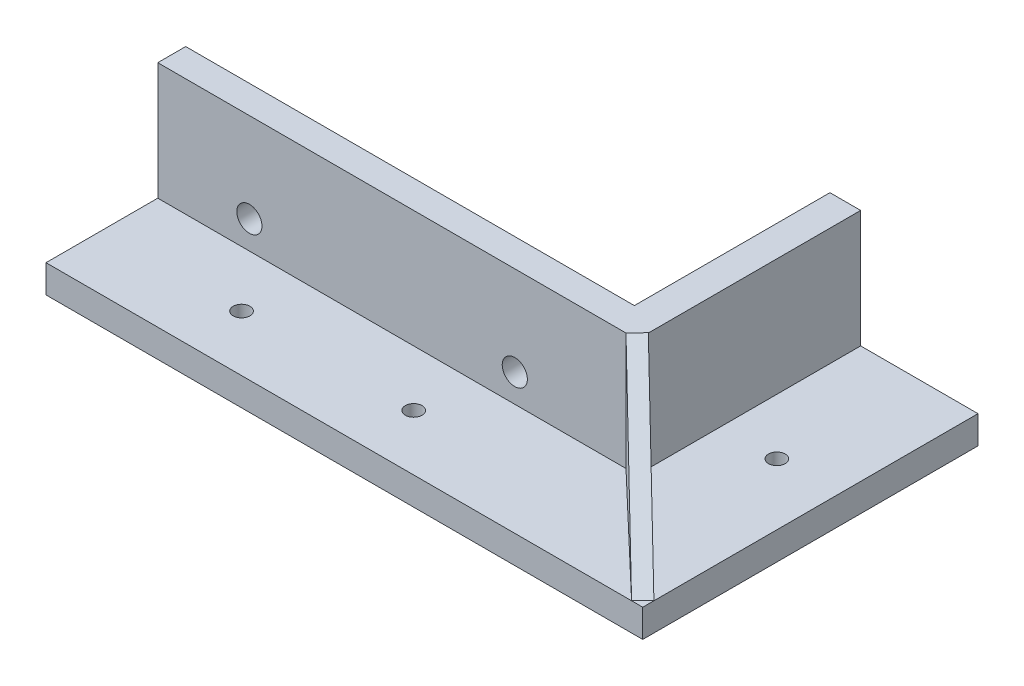
ISO-10303-21;
HEADER;
FILE_DESCRIPTION(('STEP AP214'),'2;1');
FILE_NAME('part.step','',(''),(''),'','','');
FILE_SCHEMA(('AUTOMOTIVE_DESIGN { 1 0 10303 214 1 1 1 1 }'));
ENDSEC;
DATA;
#1=APPLICATION_CONTEXT('core data for automotive mechanical design processes');
#2=APPLICATION_PROTOCOL_DEFINITION('international standard','automotive_design',2000,#1);
#3=PRODUCT_CONTEXT('',#1,'mechanical');
#4=PRODUCT('Part','Part','',(#3));
#5=PRODUCT_RELATED_PRODUCT_CATEGORY('part','',(#4));
#6=PRODUCT_DEFINITION_FORMATION('','',#4);
#7=PRODUCT_DEFINITION_CONTEXT('part definition',#1,'design');
#8=PRODUCT_DEFINITION('design','',#6,#7);
#9=PRODUCT_DEFINITION_SHAPE('','',#8);
#10=(LENGTH_UNIT() NAMED_UNIT(*) SI_UNIT(.MILLI.,.METRE.));
#11=(NAMED_UNIT(*) PLANE_ANGLE_UNIT() SI_UNIT($,.RADIAN.));
#12=(NAMED_UNIT(*) SI_UNIT($,.STERADIAN.) SOLID_ANGLE_UNIT());
#13=UNCERTAINTY_MEASURE_WITH_UNIT(LENGTH_MEASURE(1.E-05),#10,'distance_accuracy_value','');
#14=(GEOMETRIC_REPRESENTATION_CONTEXT(3) GLOBAL_UNCERTAINTY_ASSIGNED_CONTEXT((#13)) GLOBAL_UNIT_ASSIGNED_CONTEXT((#10,
#11,#12)) REPRESENTATION_CONTEXT('',''));
#15=CARTESIAN_POINT('',(0.,0.,0.));
#16=DIRECTION('',(0.,0.,1.));
#17=DIRECTION('',(1.,0.,0.));
#18=AXIS2_PLACEMENT_3D('',#15,#16,#17);
#19=CARTESIAN_POINT('',(0.,5.,-2.49999999999999));
#20=DIRECTION('',(0.,0.,-1.));
#21=DIRECTION('',(-1.,0.,0.));
#22=AXIS2_PLACEMENT_3D('',#19,#20,#21);
#23=PLANE('',#22);
#24=CARTESIAN_POINT('',(-24.,10.,-2.5));
#25=DIRECTION('',(0.,0.,-1.));
#26=DIRECTION('',(-1.,0.,0.));
#27=AXIS2_PLACEMENT_3D('',#24,#25,#26);
#28=CIRCLE('',#27,2.25);
#29=CARTESIAN_POINT('',(-26.25,10.,-2.5));
#30=VERTEX_POINT('',#29);
#31=EDGE_CURVE('E202',#30,#30,#28,.T.);
#32=ORIENTED_EDGE('',*,*,#31,.F.);
#33=EDGE_LOOP('',(#32));
#34=FACE_BOUND('',#33,.T.);
#35=CARTESIAN_POINT('',(23.5,10.,-2.5));
#36=DIRECTION('',(0.,0.,-1.));
#37=DIRECTION('',(-1.,0.,0.));
#38=AXIS2_PLACEMENT_3D('',#35,#36,#37);
#39=CIRCLE('',#38,2.25);
#40=CARTESIAN_POINT('',(21.25,10.,-2.5));
#41=VERTEX_POINT('',#40);
#42=EDGE_CURVE('E197',#41,#41,#39,.T.);
#43=ORIENTED_EDGE('',*,*,#42,.F.);
#44=EDGE_LOOP('',(#43));
#45=FACE_BOUND('',#44,.T.);
#46=DIRECTION('',(1.,0.,0.));
#47=VECTOR('',#46,1.);
#48=CARTESIAN_POINT('',(0.,26.,-2.49999999999999));
#49=LINE('',#48,#47);
#50=CARTESIAN_POINT('',(-40.4,26.,-2.49999999999996));
#51=VERTEX_POINT('',#50);
#52=CARTESIAN_POINT('',(39.9,26.,-2.49999999999999));
#53=VERTEX_POINT('',#52);
#54=EDGE_CURVE('E52',#51,#53,#49,.T.);
#55=ORIENTED_EDGE('',*,*,#54,.T.);
#56=DIRECTION('',(0.,1.,0.));
#57=VECTOR('',#56,1.);
#58=CARTESIAN_POINT('',(39.9,26.,-2.49999999999999));
#59=LINE('',#58,#57);
#60=CARTESIAN_POINT('',(39.9,0.,-2.49999999999999));
#61=VERTEX_POINT('',#60);
#62=EDGE_CURVE('E56',#61,#53,#59,.T.);
#63=ORIENTED_EDGE('',*,*,#62,.F.);
#64=DIRECTION('',(1.,0.,0.));
#65=VECTOR('',#64,1.);
#66=CARTESIAN_POINT('',(0.,0.,-2.49999999999999));
#67=LINE('',#66,#65);
#68=CARTESIAN_POINT('',(-40.4,0.,-2.49999999999999));
#69=VERTEX_POINT('',#68);
#70=EDGE_CURVE('E142',#69,#61,#67,.T.);
#71=ORIENTED_EDGE('',*,*,#70,.F.);
#72=DIRECTION('',(0.,-1.,0.));
#73=VECTOR('',#72,1.);
#74=CARTESIAN_POINT('',(-40.4,5.,-2.49999999999999));
#75=LINE('',#74,#73);
#76=EDGE_CURVE('E11',#51,#69,#75,.T.);
#77=ORIENTED_EDGE('',*,*,#76,.F.);
#78=EDGE_LOOP('',(#55,#63,#71,#77));
#79=FACE_BOUND('',#78,.T.);
#80=ADVANCED_FACE('F37',(#34,#45,#79),#23,.T.);
#81=CARTESIAN_POINT('',(0.,5.,22.5));
#82=DIRECTION('',(0.,0.,-1.));
#83=DIRECTION('',(-1.,0.,0.));
#84=AXIS2_PLACEMENT_3D('',#81,#82,#83);
#85=PLANE('',#84);
#86=DIRECTION('',(1.,0.,0.));
#87=VECTOR('',#86,1.);
#88=CARTESIAN_POINT('',(0.,5.,22.5));
#89=LINE('',#88,#87);
#90=CARTESIAN_POINT('',(-40.4,5.,22.5));
#91=VERTEX_POINT('',#90);
#92=CARTESIAN_POINT('',(64.4,5.,22.5));
#93=VERTEX_POINT('',#92);
#94=EDGE_CURVE('E236',#91,#93,#89,.T.);
#95=ORIENTED_EDGE('',*,*,#94,.F.);
#96=DIRECTION('',(0.,-1.,0.));
#97=VECTOR('',#96,1.);
#98=CARTESIAN_POINT('',(-40.4,5.,22.5));
#99=LINE('',#98,#97);
#100=CARTESIAN_POINT('',(-40.4,0.,22.5));
#101=VERTEX_POINT('',#100);
#102=EDGE_CURVE('E162',#91,#101,#99,.T.);
#103=ORIENTED_EDGE('',*,*,#102,.T.);
#104=DIRECTION('',(1.,0.,0.));
#105=VECTOR('',#104,1.);
#106=CARTESIAN_POINT('',(0.,0.,22.5));
#107=LINE('',#106,#105);
#108=CARTESIAN_POINT('',(66.4,0.,22.5));
#109=VERTEX_POINT('',#108);
#110=EDGE_CURVE('E235',#101,#109,#107,.T.);
#111=ORIENTED_EDGE('',*,*,#110,.T.);
#112=DIRECTION('',(0.,-1.,0.));
#113=VECTOR('',#112,1.);
#114=CARTESIAN_POINT('',(66.4,5.,22.5));
#115=LINE('',#114,#113);
#116=CARTESIAN_POINT('',(66.4,5.,22.5));
#117=VERTEX_POINT('',#116);
#118=EDGE_CURVE('E226',#117,#109,#115,.T.);
#119=ORIENTED_EDGE('',*,*,#118,.F.);
#120=DIRECTION('',(1.,0.,0.));
#121=VECTOR('',#120,1.);
#122=CARTESIAN_POINT('',(0.,5.,22.5));
#123=LINE('',#122,#121);
#124=EDGE_CURVE('E180',#93,#117,#123,.T.);
#125=ORIENTED_EDGE('',*,*,#124,.F.);
#126=EDGE_LOOP('',(#95,#103,#111,#119,#125));
#127=FACE_BOUND('',#126,.T.);
#128=ADVANCED_FACE('F39',(#127),#85,.F.);
#129=CARTESIAN_POINT('',(0.,26.,0.));
#130=DIRECTION('',(0.,1.,0.));
#131=DIRECTION('',(0.,0.,1.));
#132=AXIS2_PLACEMENT_3D('',#129,#130,#131);
#133=PLANE('',#132);
#134=DIRECTION('',(0.,0.,-1.));
#135=VECTOR('',#134,1.);
#136=CARTESIAN_POINT('',(-40.4,26.,82.5));
#137=LINE('',#136,#135);
#138=CARTESIAN_POINT('',(-40.4,26.,2.50000000000003));
#139=VERTEX_POINT('',#138);
#140=EDGE_CURVE('E153',#139,#51,#137,.T.);
#141=ORIENTED_EDGE('',*,*,#140,.F.);
#142=DIRECTION('',(1.,0.,0.));
#143=VECTOR('',#142,1.);
#144=CARTESIAN_POINT('',(0.,26.,2.5));
#145=LINE('',#144,#143);
#146=CARTESIAN_POINT('',(43.4,26.,2.49999999999999));
#147=VERTEX_POINT('',#146);
#148=EDGE_CURVE('E229',#139,#147,#145,.T.);
#149=ORIENTED_EDGE('',*,*,#148,.T.);
#150=DIRECTION('',(0.689655172413793,0.,-0.724137931034483));
#151=VECTOR('',#150,1.);
#152=CARTESIAN_POINT('',(24.0064209274673,26.,22.8632580261593));
#153=LINE('',#152,#151);
#154=CARTESIAN_POINT('',(45.4,26.,0.400000000000019));
#155=VERTEX_POINT('',#154);
#156=EDGE_CURVE('E177',#147,#155,#153,.T.);
#157=ORIENTED_EDGE('',*,*,#156,.T.);
#158=DIRECTION('',(0.,0.,1.));
#159=VECTOR('',#158,1.);
#160=CARTESIAN_POINT('',(45.4,26.,0.));
#161=LINE('',#160,#159);
#162=CARTESIAN_POINT('',(45.4,26.,-37.5));
#163=VERTEX_POINT('',#162);
#164=EDGE_CURVE('E207',#163,#155,#161,.T.);
#165=ORIENTED_EDGE('',*,*,#164,.F.);
#166=DIRECTION('',(1.,0.,0.));
#167=VECTOR('',#166,1.);
#168=CARTESIAN_POINT('',(0.,26.,-37.5));
#169=LINE('',#168,#167);
#170=CARTESIAN_POINT('',(39.9,26.,-37.5));
#171=VERTEX_POINT('',#170);
#172=EDGE_CURVE('E205',#171,#163,#169,.T.);
#173=ORIENTED_EDGE('',*,*,#172,.F.);
#174=DIRECTION('',(0.,0.,-1.));
#175=VECTOR('',#174,1.);
#176=CARTESIAN_POINT('',(39.9,26.,-37.5));
#177=LINE('',#176,#175);
#178=EDGE_CURVE('E148',#53,#171,#177,.T.);
#179=ORIENTED_EDGE('',*,*,#178,.F.);
#180=ORIENTED_EDGE('',*,*,#54,.F.);
#181=EDGE_LOOP('',(#141,#149,#157,#165,#173,#179,#180));
#182=FACE_BOUND('',#181,.T.);
#183=ADVANCED_FACE('F280',(#182),#133,.T.);
#184=CARTESIAN_POINT('',(66.4,5.,0.));
#185=DIRECTION('',(1.,0.,0.));
#186=DIRECTION('',(0.,0.,-1.));
#187=AXIS2_PLACEMENT_3D('',#184,#185,#186);
#188=PLANE('',#187);
#189=DIRECTION('',(0.,0.,1.));
#190=VECTOR('',#189,1.);
#191=CARTESIAN_POINT('',(66.4,5.,0.));
#192=LINE('',#191,#190);
#193=CARTESIAN_POINT('',(66.4,5.,-37.5));
#194=VERTEX_POINT('',#193);
#195=EDGE_CURVE('E216',#194,#117,#192,.T.);
#196=ORIENTED_EDGE('',*,*,#195,.T.);
#197=ORIENTED_EDGE('',*,*,#118,.T.);
#198=DIRECTION('',(0.,0.,1.));
#199=VECTOR('',#198,1.);
#200=CARTESIAN_POINT('',(66.4,0.,0.));
#201=LINE('',#200,#199);
#202=CARTESIAN_POINT('',(66.4,0.,-37.5));
#203=VERTEX_POINT('',#202);
#204=EDGE_CURVE('E133',#203,#109,#201,.T.);
#205=ORIENTED_EDGE('',*,*,#204,.F.);
#206=DIRECTION('',(0.,-1.,0.));
#207=VECTOR('',#206,1.);
#208=CARTESIAN_POINT('',(66.4,5.,-37.5));
#209=LINE('',#208,#207);
#210=EDGE_CURVE('E129',#194,#203,#209,.T.);
#211=ORIENTED_EDGE('',*,*,#210,.F.);
#212=EDGE_LOOP('',(#196,#197,#205,#211));
#213=FACE_BOUND('',#212,.T.);
#214=ADVANCED_FACE('F303',(#213),#188,.T.);
#215=CARTESIAN_POINT('',(45.4,26.,0.));
#216=DIRECTION('',(1.,0.,0.));
#217=DIRECTION('',(0.,0.,-1.));
#218=AXIS2_PLACEMENT_3D('',#215,#216,#217);
#219=PLANE('',#218);
#220=ORIENTED_EDGE('',*,*,#164,.T.);
#221=DIRECTION('',(0.,-0.446788032480034,0.894639845989782));
#222=VECTOR('',#221,1.);
#223=CARTESIAN_POINT('',(45.4,26.1598857506272,0.0798478183869559));
#224=LINE('',#223,#222);
#225=CARTESIAN_POINT('',(45.4,25.9500594530321,0.500000000000007));
#226=VERTEX_POINT('',#225);
#227=EDGE_CURVE('E174',#155,#226,#224,.T.);
#228=ORIENTED_EDGE('',*,*,#227,.T.);
#229=DIRECTION('',(0.,-1.,0.));
#230=VECTOR('',#229,1.);
#231=CARTESIAN_POINT('',(45.4,26.,0.500000000000007));
#232=LINE('',#231,#230);
#233=CARTESIAN_POINT('',(45.4,5.,0.500000000000007));
#234=VERTEX_POINT('',#233);
#235=EDGE_CURVE('E191',#226,#234,#232,.T.);
#236=ORIENTED_EDGE('',*,*,#235,.T.);
#237=DIRECTION('',(0.,0.,-1.));
#238=VECTOR('',#237,1.);
#239=CARTESIAN_POINT('',(45.4,5.,0.));
#240=LINE('',#239,#238);
#241=CARTESIAN_POINT('',(45.4,5.00000000000001,-37.5));
#242=VERTEX_POINT('',#241);
#243=EDGE_CURVE('E134',#234,#242,#240,.T.);
#244=ORIENTED_EDGE('',*,*,#243,.T.);
#245=DIRECTION('',(0.,-1.,0.));
#246=VECTOR('',#245,1.);
#247=CARTESIAN_POINT('',(45.4,26.,-37.5));
#248=LINE('',#247,#246);
#249=EDGE_CURVE('E210',#163,#242,#248,.T.);
#250=ORIENTED_EDGE('',*,*,#249,.F.);
#251=EDGE_LOOP('',(#220,#228,#236,#244,#250));
#252=FACE_BOUND('',#251,.T.);
#253=ADVANCED_FACE('F306',(#252),#219,.T.);
#254=CARTESIAN_POINT('',(66.4,26.,20.5));
#255=DIRECTION('',(0.689655172413793,0.,-0.724137931034483));
#256=DIRECTION('',(-0.724137931034483,0.,-0.689655172413793));
#257=AXIS2_PLACEMENT_3D('',#254,#255,#256);
#258=PLANE('',#257);
#259=ORIENTED_EDGE('',*,*,#235,.F.);
#260=DIRECTION('',(0.586509812151843,-0.586509812151843,0.558580773477945));
#261=VECTOR('',#260,1.);
#262=CARTESIAN_POINT('',(59.1589518087263,12.1911076443058,13.6037636273584));
#263=LINE('',#262,#261);
#264=CARTESIAN_POINT('',(66.3500594530321,5.,20.4524375743163));
#265=VERTEX_POINT('',#264);
#266=EDGE_CURVE('E171',#226,#265,#263,.T.);
#267=ORIENTED_EDGE('',*,*,#266,.T.);
#268=DIRECTION('',(0.724137931034483,0.,0.689655172413793));
#269=VECTOR('',#268,1.);
#270=CARTESIAN_POINT('',(66.4,5.,20.5));
#271=LINE('',#270,#269);
#272=EDGE_CURVE('E183',#234,#265,#271,.T.);
#273=ORIENTED_EDGE('',*,*,#272,.F.);
#274=EDGE_LOOP('',(#259,#267,#273));
#275=FACE_BOUND('',#274,.T.);
#276=ADVANCED_FACE('F311',(#275),#258,.T.);
#277=CARTESIAN_POINT('',(43.4,26.,2.50000000000001));
#278=DIRECTION('',(-0.689655172413793,0.,0.724137931034483));
#279=DIRECTION('',(0.724137931034483,0.,0.689655172413793));
#280=AXIS2_PLACEMENT_3D('',#277,#278,#279);
#281=PLANE('',#280);
#282=DIRECTION('',(-0.724137931034483,0.,-0.689655172413793));
#283=VECTOR('',#282,1.);
#284=CARTESIAN_POINT('',(43.4,5.,2.50000000000001));
#285=LINE('',#284,#283);
#286=CARTESIAN_POINT('',(43.4,5.,2.49999999999999));
#287=VERTEX_POINT('',#286);
#288=EDGE_CURVE('E186',#93,#287,#285,.T.);
#289=ORIENTED_EDGE('',*,*,#288,.F.);
#290=DIRECTION('',(-0.586509812151843,0.586509812151843,-0.558580773477946));
#291=VECTOR('',#290,1.);
#292=CARTESIAN_POINT('',(64.4,5.,22.5));
#293=LINE('',#292,#291);
#294=EDGE_CURVE('E165',#93,#147,#293,.T.);
#295=ORIENTED_EDGE('',*,*,#294,.T.);
#296=DIRECTION('',(0.,-1.,0.));
#297=VECTOR('',#296,1.);
#298=CARTESIAN_POINT('',(43.4,26.,2.50000000000001));
#299=LINE('',#298,#297);
#300=EDGE_CURVE('E188',#147,#287,#299,.T.);
#301=ORIENTED_EDGE('',*,*,#300,.T.);
#302=EDGE_LOOP('',(#289,#295,#301));
#303=FACE_BOUND('',#302,.T.);
#304=ADVANCED_FACE('F297',(#303),#281,.T.);
#305=CARTESIAN_POINT('',(0.,5.,0.));
#306=DIRECTION('',(0.,1.,0.));
#307=DIRECTION('',(0.,0.,1.));
#308=AXIS2_PLACEMENT_3D('',#305,#306,#307);
#309=PLANE('',#308);
#310=ORIENTED_EDGE('',*,*,#124,.T.);
#311=ORIENTED_EDGE('',*,*,#195,.F.);
#312=DIRECTION('',(1.,0.,0.));
#313=VECTOR('',#312,1.);
#314=CARTESIAN_POINT('',(0.,5.,-37.5));
#315=LINE('',#314,#313);
#316=EDGE_CURVE('E214',#242,#194,#315,.T.);
#317=ORIENTED_EDGE('',*,*,#316,.F.);
#318=ORIENTED_EDGE('',*,*,#243,.F.);
#319=ORIENTED_EDGE('',*,*,#272,.T.);
#320=DIRECTION('',(-0.689655172413793,0.,0.724137931034483));
#321=VECTOR('',#320,1.);
#322=CARTESIAN_POINT('',(78.8827586206896,5.,7.29310344827587));
#323=LINE('',#322,#321);
#324=EDGE_CURVE('E168',#265,#93,#323,.T.);
#325=ORIENTED_EDGE('',*,*,#324,.T.);
#326=EDGE_LOOP('',(#310,#311,#317,#318,#319,#325));
#327=FACE_BOUND('',#326,.T.);
#328=CARTESIAN_POINT('',(55.4,5.,-12.5));
#329=DIRECTION('',(0.,1.,0.));
#330=DIRECTION('',(0.,0.,1.));
#331=AXIS2_PLACEMENT_3D('',#328,#329,#330);
#332=CIRCLE('',#331,1.5);
#333=CARTESIAN_POINT('',(55.4,5.,-11.));
#334=VERTEX_POINT('',#333);
#335=EDGE_CURVE('E219',#334,#334,#332,.F.);
#336=ORIENTED_EDGE('',*,*,#335,.T.);
#337=EDGE_LOOP('',(#336));
#338=FACE_BOUND('',#337,.T.);
#339=ADVANCED_FACE('F293',(#327,#338),#309,.T.);
#340=DIRECTION('',(0.,0.,-1.));
#341=VECTOR('',#340,1.);
#342=CARTESIAN_POINT('',(-40.4,5.,0.));
#343=LINE('',#342,#341);
#344=CARTESIAN_POINT('',(-40.4,5.,2.50000000000001));
#345=VERTEX_POINT('',#344);
#346=EDGE_CURVE('E160',#91,#345,#343,.T.);
#347=ORIENTED_EDGE('',*,*,#346,.F.);
#348=ORIENTED_EDGE('',*,*,#94,.T.);
#349=ORIENTED_EDGE('',*,*,#288,.T.);
#350=DIRECTION('',(-1.,0.,0.));
#351=VECTOR('',#350,1.);
#352=CARTESIAN_POINT('',(0.,5.,2.5));
#353=LINE('',#352,#351);
#354=EDGE_CURVE('E232',#287,#345,#353,.T.);
#355=ORIENTED_EDGE('',*,*,#354,.T.);
#356=EDGE_LOOP('',(#347,#348,#349,#355));
#357=FACE_BOUND('',#356,.T.);
#358=CARTESIAN_POINT('',(15.4,5.,12.5));
#359=DIRECTION('',(0.,1.,0.));
#360=DIRECTION('',(0.,0.,1.));
#361=AXIS2_PLACEMENT_3D('',#358,#359,#360);
#362=CIRCLE('',#361,1.5);
#363=CARTESIAN_POINT('',(15.4,5.,14.));
#364=VERTEX_POINT('',#363);
#365=EDGE_CURVE('E45',#364,#364,#362,.F.);
#366=ORIENTED_EDGE('',*,*,#365,.T.);
#367=EDGE_LOOP('',(#366));
#368=FACE_BOUND('',#367,.T.);
#369=CARTESIAN_POINT('',(-15.4,5.,12.5));
#370=DIRECTION('',(0.,1.,0.));
#371=DIRECTION('',(0.,0.,1.));
#372=AXIS2_PLACEMENT_3D('',#369,#370,#371);
#373=CIRCLE('',#372,1.5);
#374=CARTESIAN_POINT('',(-15.4,5.,14.));
#375=VERTEX_POINT('',#374);
#376=EDGE_CURVE('E238',#375,#375,#373,.T.);
#377=ORIENTED_EDGE('',*,*,#376,.F.);
#378=EDGE_LOOP('',(#377));
#379=FACE_BOUND('',#378,.T.);
#380=ADVANCED_FACE('F296',(#357,#368,#379),#309,.T.);
#381=CARTESIAN_POINT('',(0.,26.,2.5));
#382=DIRECTION('',(0.,0.,-1.));
#383=DIRECTION('',(-1.,0.,0.));
#384=AXIS2_PLACEMENT_3D('',#381,#382,#383);
#385=PLANE('',#384);
#386=CARTESIAN_POINT('',(23.5,10.,2.5));
#387=DIRECTION('',(0.,0.,1.));
#388=DIRECTION('',(1.,0.,0.));
#389=AXIS2_PLACEMENT_3D('',#386,#387,#388);
#390=CIRCLE('',#389,2.25);
#391=CARTESIAN_POINT('',(25.75,10.,2.5));
#392=VERTEX_POINT('',#391);
#393=EDGE_CURVE('E193',#392,#392,#390,.T.);
#394=ORIENTED_EDGE('',*,*,#393,.F.);
#395=EDGE_LOOP('',(#394));
#396=FACE_BOUND('',#395,.T.);
#397=CARTESIAN_POINT('',(-24.,10.,2.5));
#398=DIRECTION('',(0.,0.,1.));
#399=DIRECTION('',(1.,0.,0.));
#400=AXIS2_PLACEMENT_3D('',#397,#398,#399);
#401=CIRCLE('',#400,2.25);
#402=CARTESIAN_POINT('',(-21.75,10.,2.5));
#403=VERTEX_POINT('',#402);
#404=EDGE_CURVE('E194',#403,#403,#401,.T.);
#405=ORIENTED_EDGE('',*,*,#404,.F.);
#406=EDGE_LOOP('',(#405));
#407=FACE_BOUND('',#406,.T.);
#408=ORIENTED_EDGE('',*,*,#148,.F.);
#409=DIRECTION('',(0.,-1.,0.));
#410=VECTOR('',#409,1.);
#411=CARTESIAN_POINT('',(-40.4,26.,2.50000000000001));
#412=LINE('',#411,#410);
#413=EDGE_CURVE('E156',#139,#345,#412,.T.);
#414=ORIENTED_EDGE('',*,*,#413,.T.);
#415=ORIENTED_EDGE('',*,*,#354,.F.);
#416=ORIENTED_EDGE('',*,*,#300,.F.);
#417=EDGE_LOOP('',(#408,#414,#415,#416));
#418=FACE_BOUND('',#417,.T.);
#419=ADVANCED_FACE('F288',(#396,#407,#418),#385,.F.);
#420=CARTESIAN_POINT('',(-15.4,5.,12.5));
#421=DIRECTION('',(0.,-1.,0.));
#422=DIRECTION('',(0.,0.,-1.));
#423=AXIS2_PLACEMENT_3D('',#420,#421,#422);
#424=CYLINDRICAL_SURFACE('',#423,1.5);
#425=ORIENTED_EDGE('',*,*,#376,.T.);
#426=EDGE_LOOP('',(#425));
#427=FACE_BOUND('',#426,.T.);
#428=CARTESIAN_POINT('',(-15.4,0.,12.5));
#429=DIRECTION('',(0.,1.,0.));
#430=DIRECTION('',(0.,0.,1.));
#431=AXIS2_PLACEMENT_3D('',#428,#429,#430);
#432=CIRCLE('',#431,1.5);
#433=CARTESIAN_POINT('',(-15.4,0.,14.));
#434=VERTEX_POINT('',#433);
#435=EDGE_CURVE('E246',#434,#434,#432,.T.);
#436=ORIENTED_EDGE('',*,*,#435,.F.);
#437=EDGE_LOOP('',(#436));
#438=FACE_BOUND('',#437,.T.);
#439=ADVANCED_FACE('F285',(#427,#438),#424,.F.);
#440=CARTESIAN_POINT('',(15.4,5.,12.5));
#441=DIRECTION('',(0.,-1.,0.));
#442=DIRECTION('',(0.,0.,-1.));
#443=AXIS2_PLACEMENT_3D('',#440,#441,#442);
#444=CYLINDRICAL_SURFACE('',#443,1.5);
#445=ORIENTED_EDGE('',*,*,#365,.F.);
#446=EDGE_LOOP('',(#445));
#447=FACE_BOUND('',#446,.T.);
#448=CARTESIAN_POINT('',(15.4,0.,12.5));
#449=DIRECTION('',(0.,1.,0.));
#450=DIRECTION('',(0.,0.,1.));
#451=AXIS2_PLACEMENT_3D('',#448,#449,#450);
#452=CIRCLE('',#451,1.5);
#453=CARTESIAN_POINT('',(15.4,0.,14.));
#454=VERTEX_POINT('',#453);
#455=EDGE_CURVE('E239',#454,#454,#452,.F.);
#456=ORIENTED_EDGE('',*,*,#455,.T.);
#457=EDGE_LOOP('',(#456));
#458=FACE_BOUND('',#457,.T.);
#459=ADVANCED_FACE('F251',(#447,#458),#444,.F.);
#460=CARTESIAN_POINT('',(0.,0.,0.));
#461=DIRECTION('',(0.,1.,0.));
#462=DIRECTION('',(0.,0.,1.));
#463=AXIS2_PLACEMENT_3D('',#460,#461,#462);
#464=PLANE('',#463);
#465=ORIENTED_EDGE('',*,*,#110,.F.);
#466=DIRECTION('',(0.,0.,-1.));
#467=VECTOR('',#466,1.);
#468=CARTESIAN_POINT('',(-40.4,0.,82.5));
#469=LINE('',#468,#467);
#470=EDGE_CURVE('E154',#101,#69,#469,.T.);
#471=ORIENTED_EDGE('',*,*,#470,.T.);
#472=ORIENTED_EDGE('',*,*,#70,.T.);
#473=DIRECTION('',(0.,0.,1.));
#474=VECTOR('',#473,1.);
#475=CARTESIAN_POINT('',(39.9,0.,-2.49999999999999));
#476=LINE('',#475,#474);
#477=CARTESIAN_POINT('',(39.9,0.,-37.5));
#478=VERTEX_POINT('',#477);
#479=EDGE_CURVE('E137',#478,#61,#476,.T.);
#480=ORIENTED_EDGE('',*,*,#479,.F.);
#481=DIRECTION('',(1.,0.,0.));
#482=VECTOR('',#481,1.);
#483=CARTESIAN_POINT('',(0.,0.,-37.5));
#484=LINE('',#483,#482);
#485=EDGE_CURVE('E122',#478,#203,#484,.T.);
#486=ORIENTED_EDGE('',*,*,#485,.T.);
#487=ORIENTED_EDGE('',*,*,#204,.T.);
#488=EDGE_LOOP('',(#465,#471,#472,#480,#486,#487));
#489=FACE_BOUND('',#488,.T.);
#490=ORIENTED_EDGE('',*,*,#455,.F.);
#491=EDGE_LOOP('',(#490));
#492=FACE_BOUND('',#491,.T.);
#493=ORIENTED_EDGE('',*,*,#435,.T.);
#494=EDGE_LOOP('',(#493));
#495=FACE_BOUND('',#494,.T.);
#496=CARTESIAN_POINT('',(55.4,0.,-12.5));
#497=DIRECTION('',(0.,1.,0.));
#498=DIRECTION('',(0.,0.,1.));
#499=AXIS2_PLACEMENT_3D('',#496,#497,#498);
#500=CIRCLE('',#499,1.5);
#501=CARTESIAN_POINT('',(55.4,0.,-11.));
#502=VERTEX_POINT('',#501);
#503=EDGE_CURVE('E217',#502,#502,#500,.F.);
#504=ORIENTED_EDGE('',*,*,#503,.F.);
#505=EDGE_LOOP('',(#504));
#506=FACE_BOUND('',#505,.T.);
#507=ADVANCED_FACE('F139',(#489,#492,#495,#506),#464,.F.);
#508=CARTESIAN_POINT('',(0.,5.,-37.5));
#509=DIRECTION('',(0.,0.,-1.));
#510=DIRECTION('',(-1.,0.,0.));
#511=AXIS2_PLACEMENT_3D('',#508,#509,#510);
#512=PLANE('',#511);
#513=ORIENTED_EDGE('',*,*,#210,.T.);
#514=ORIENTED_EDGE('',*,*,#485,.F.);
#515=DIRECTION('',(0.,-1.,0.));
#516=VECTOR('',#515,1.);
#517=CARTESIAN_POINT('',(39.9,0.,-37.5));
#518=LINE('',#517,#516);
#519=EDGE_CURVE('E127',#171,#478,#518,.T.);
#520=ORIENTED_EDGE('',*,*,#519,.F.);
#521=ORIENTED_EDGE('',*,*,#172,.T.);
#522=ORIENTED_EDGE('',*,*,#249,.T.);
#523=ORIENTED_EDGE('',*,*,#316,.T.);
#524=EDGE_LOOP('',(#513,#514,#520,#521,#522,#523));
#525=FACE_BOUND('',#524,.T.);
#526=ADVANCED_FACE('F124',(#525),#512,.T.);
#527=CARTESIAN_POINT('',(55.4,5.,-12.5));
#528=DIRECTION('',(0.,-1.,0.));
#529=DIRECTION('',(0.,0.,-1.));
#530=AXIS2_PLACEMENT_3D('',#527,#528,#529);
#531=CYLINDRICAL_SURFACE('',#530,1.5);
#532=ORIENTED_EDGE('',*,*,#335,.F.);
#533=EDGE_LOOP('',(#532));
#534=FACE_BOUND('',#533,.T.);
#535=ORIENTED_EDGE('',*,*,#503,.T.);
#536=EDGE_LOOP('',(#535));
#537=FACE_BOUND('',#536,.T.);
#538=ADVANCED_FACE('F259',(#534,#537),#531,.F.);
#539=CARTESIAN_POINT('',(23.5,10.,-23.5));
#540=DIRECTION('',(0.,0.,1.));
#541=DIRECTION('',(1.,0.,0.));
#542=AXIS2_PLACEMENT_3D('',#539,#540,#541);
#543=CYLINDRICAL_SURFACE('',#542,2.25);
#544=ORIENTED_EDGE('',*,*,#42,.T.);
#545=EDGE_LOOP('',(#544));
#546=FACE_BOUND('',#545,.T.);
#547=ORIENTED_EDGE('',*,*,#393,.T.);
#548=EDGE_LOOP('',(#547));
#549=FACE_BOUND('',#548,.T.);
#550=ADVANCED_FACE('F261',(#546,#549),#543,.F.);
#551=CARTESIAN_POINT('',(-24.,10.,-23.5));
#552=DIRECTION('',(0.,0.,1.));
#553=DIRECTION('',(1.,0.,0.));
#554=AXIS2_PLACEMENT_3D('',#551,#552,#553);
#555=CYLINDRICAL_SURFACE('',#554,2.25);
#556=ORIENTED_EDGE('',*,*,#31,.T.);
#557=EDGE_LOOP('',(#556));
#558=FACE_BOUND('',#557,.T.);
#559=ORIENTED_EDGE('',*,*,#404,.T.);
#560=EDGE_LOOP('',(#559));
#561=FACE_BOUND('',#560,.T.);
#562=ADVANCED_FACE('F268',(#558,#561),#555,.F.);
#563=CARTESIAN_POINT('',(78.8827586206896,5.,7.29310344827587));
#564=DIRECTION('',(0.424714001903059,0.809942121543021,0.404489525621961));
#565=DIRECTION('',(-0.885625332501467,0.464400441894348,0.));
#566=AXIS2_PLACEMENT_3D('',#563,#564,#565);
#567=PLANE('',#566);
#568=ORIENTED_EDGE('',*,*,#294,.F.);
#569=ORIENTED_EDGE('',*,*,#324,.F.);
#570=ORIENTED_EDGE('',*,*,#266,.F.);
#571=ORIENTED_EDGE('',*,*,#227,.F.);
#572=ORIENTED_EDGE('',*,*,#156,.F.);
#573=EDGE_LOOP('',(#568,#569,#570,#571,#572));
#574=FACE_BOUND('',#573,.T.);
#575=ADVANCED_FACE('F331',(#574),#567,.T.);
#576=CARTESIAN_POINT('',(-40.4,0.,82.5));
#577=DIRECTION('',(1.,0.,0.));
#578=DIRECTION('',(0.,0.,-1.));
#579=AXIS2_PLACEMENT_3D('',#576,#577,#578);
#580=PLANE('',#579);
#581=ORIENTED_EDGE('',*,*,#346,.T.);
#582=ORIENTED_EDGE('',*,*,#413,.F.);
#583=ORIENTED_EDGE('',*,*,#140,.T.);
#584=ORIENTED_EDGE('',*,*,#76,.T.);
#585=ORIENTED_EDGE('',*,*,#470,.F.);
#586=ORIENTED_EDGE('',*,*,#102,.F.);
#587=EDGE_LOOP('',(#581,#582,#583,#584,#585,#586));
#588=FACE_BOUND('',#587,.T.);
#589=ADVANCED_FACE('F322',(#588),#580,.F.);
#590=CARTESIAN_POINT('',(39.9,0.,0.));
#591=DIRECTION('',(1.,0.,0.));
#592=DIRECTION('',(0.,0.,-1.));
#593=AXIS2_PLACEMENT_3D('',#590,#591,#592);
#594=PLANE('',#593);
#595=ORIENTED_EDGE('',*,*,#519,.T.);
#596=ORIENTED_EDGE('',*,*,#479,.T.);
#597=ORIENTED_EDGE('',*,*,#62,.T.);
#598=ORIENTED_EDGE('',*,*,#178,.T.);
#599=EDGE_LOOP('',(#595,#596,#597,#598));
#600=FACE_BOUND('',#599,.T.);
#601=ADVANCED_FACE('F146',(#600),#594,.F.);
#602=CLOSED_SHELL('',(#80,#128,#183,#214,#253,#276,#304,#339,#380,#419,#439,#459,#507,#526,#538,
#550,#562,#575,#589,#601));
#603=MANIFOLD_SOLID_BREP('B2',#602);
#604=ADVANCED_BREP_SHAPE_REPRESENTATION('',(#18,#603),#14);
#605=SHAPE_DEFINITION_REPRESENTATION(#9,#604);
ENDSEC;
END-ISO-10303-21;
